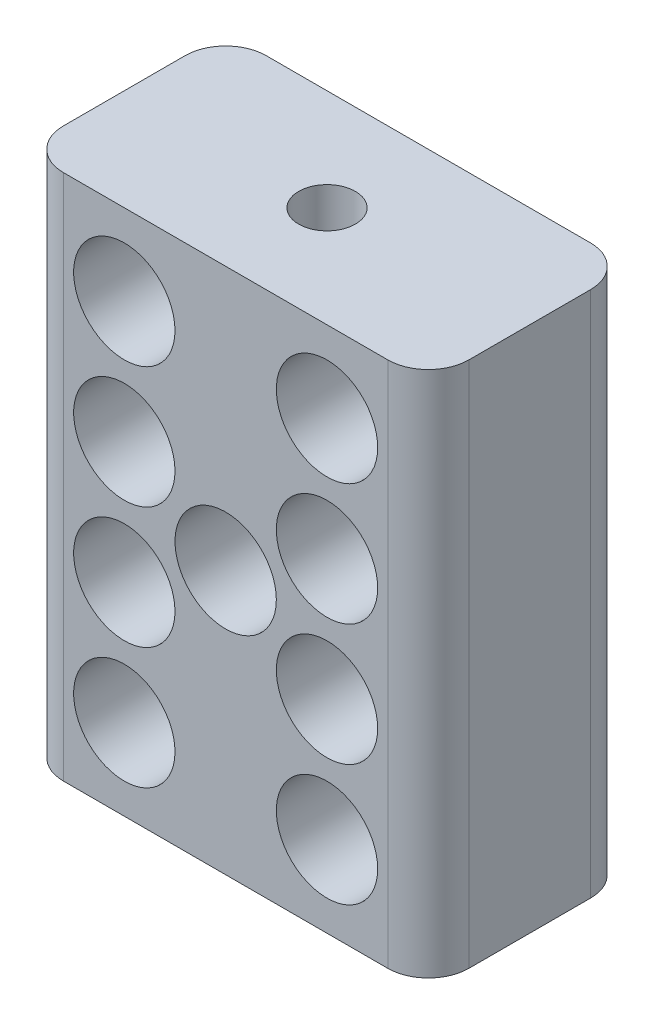
ISO-10303-21;
HEADER;
FILE_DESCRIPTION(('STEP AP214'),'2;1');
FILE_NAME('part.step','',(''),(''),'','','');
FILE_SCHEMA(('AUTOMOTIVE_DESIGN { 1 0 10303 214 1 1 1 1 }'));
ENDSEC;
DATA;
#1=APPLICATION_CONTEXT('core data for automotive mechanical design processes');
#2=APPLICATION_PROTOCOL_DEFINITION('international standard','automotive_design',2000,#1);
#3=PRODUCT_CONTEXT('',#1,'mechanical');
#4=PRODUCT('Part','Part','',(#3));
#5=PRODUCT_RELATED_PRODUCT_CATEGORY('part','',(#4));
#6=PRODUCT_DEFINITION_FORMATION('','',#4);
#7=PRODUCT_DEFINITION_CONTEXT('part definition',#1,'design');
#8=PRODUCT_DEFINITION('design','',#6,#7);
#9=PRODUCT_DEFINITION_SHAPE('','',#8);
#10=(LENGTH_UNIT() NAMED_UNIT(*) SI_UNIT(.MILLI.,.METRE.));
#11=(NAMED_UNIT(*) PLANE_ANGLE_UNIT() SI_UNIT($,.RADIAN.));
#12=(NAMED_UNIT(*) SI_UNIT($,.STERADIAN.) SOLID_ANGLE_UNIT());
#13=UNCERTAINTY_MEASURE_WITH_UNIT(LENGTH_MEASURE(1.E-05),#10,'distance_accuracy_value','');
#14=(GEOMETRIC_REPRESENTATION_CONTEXT(3) GLOBAL_UNCERTAINTY_ASSIGNED_CONTEXT((#13)) GLOBAL_UNIT_ASSIGNED_CONTEXT((#10,
#11,#12)) REPRESENTATION_CONTEXT('',''));
#15=CARTESIAN_POINT('',(0.,0.,0.));
#16=DIRECTION('',(0.,0.,1.));
#17=DIRECTION('',(1.,0.,0.));
#18=AXIS2_PLACEMENT_3D('',#15,#16,#17);
#19=CARTESIAN_POINT('',(5.,0.,5.));
#20=DIRECTION('',(1.,0.,0.));
#21=DIRECTION('',(0.,0.,-1.));
#22=AXIS2_PLACEMENT_3D('',#19,#20,#21);
#23=PLANE('',#22);
#24=DIRECTION('',(0.,0.,-1.));
#25=VECTOR('',#24,1.);
#26=CARTESIAN_POINT('',(5.,6.5,5.));
#27=LINE('',#26,#25);
#28=CARTESIAN_POINT('',(5.,6.5,4.));
#29=VERTEX_POINT('',#28);
#30=CARTESIAN_POINT('',(5.,6.5,1.));
#31=VERTEX_POINT('',#30);
#32=EDGE_CURVE('E130',#29,#31,#27,.T.);
#33=ORIENTED_EDGE('',*,*,#32,.F.);
#34=DIRECTION('',(0.,-1.,0.));
#35=VECTOR('',#34,1.);
#36=CARTESIAN_POINT('',(5.,0.,4.));
#37=LINE('',#36,#35);
#38=CARTESIAN_POINT('',(5.,-6.5,4.));
#39=VERTEX_POINT('',#38);
#40=EDGE_CURVE('E11',#29,#39,#37,.T.);
#41=ORIENTED_EDGE('',*,*,#40,.T.);
#42=DIRECTION('',(0.,0.,-1.));
#43=VECTOR('',#42,1.);
#44=CARTESIAN_POINT('',(5.,-6.5,5.));
#45=LINE('',#44,#43);
#46=CARTESIAN_POINT('',(5.,-6.5,1.));
#47=VERTEX_POINT('',#46);
#48=EDGE_CURVE('E125',#39,#47,#45,.T.);
#49=ORIENTED_EDGE('',*,*,#48,.T.);
#50=DIRECTION('',(0.,-1.,0.));
#51=VECTOR('',#50,1.);
#52=CARTESIAN_POINT('',(5.,6.5,1.));
#53=LINE('',#52,#51);
#54=EDGE_CURVE('E45',#47,#31,#53,.F.);
#55=ORIENTED_EDGE('',*,*,#54,.T.);
#56=EDGE_LOOP('',(#33,#41,#49,#55));
#57=FACE_BOUND('',#56,.T.);
#58=ADVANCED_FACE('F37',(#57),#23,.T.);
#59=CARTESIAN_POINT('',(0.,6.5,5.));
#60=DIRECTION('',(0.,1.,0.));
#61=DIRECTION('',(0.,0.,1.));
#62=AXIS2_PLACEMENT_3D('',#59,#60,#61);
#63=PLANE('',#62);
#64=CARTESIAN_POINT('',(0.,6.5,2.5));
#65=DIRECTION('',(0.,1.,0.));
#66=DIRECTION('',(0.,0.,1.));
#67=AXIS2_PLACEMENT_3D('',#64,#65,#66);
#68=CIRCLE('',#67,0.7);
#69=CARTESIAN_POINT('',(0.,6.5,3.2));
#70=VERTEX_POINT('',#69);
#71=EDGE_CURVE('E409',#70,#70,#68,.T.);
#72=ORIENTED_EDGE('',*,*,#71,.F.);
#73=EDGE_LOOP('',(#72));
#74=FACE_BOUND('',#73,.T.);
#75=DIRECTION('',(1.,0.,0.));
#76=VECTOR('',#75,1.);
#77=CARTESIAN_POINT('',(0.,6.5,0.));
#78=LINE('',#77,#76);
#79=CARTESIAN_POINT('',(-4.,6.5,0.));
#80=VERTEX_POINT('',#79);
#81=CARTESIAN_POINT('',(4.,6.5,0.));
#82=VERTEX_POINT('',#81);
#83=EDGE_CURVE('E195',#80,#82,#78,.T.);
#84=ORIENTED_EDGE('',*,*,#83,.F.);
#85=CARTESIAN_POINT('',(-4.,6.5,1.));
#86=DIRECTION('',(0.,1.,0.));
#87=DIRECTION('',(0.,0.,1.));
#88=AXIS2_PLACEMENT_3D('',#85,#86,#87);
#89=CIRCLE('',#88,1.);
#90=CARTESIAN_POINT('',(-5.,6.5,1.));
#91=VERTEX_POINT('',#90);
#92=EDGE_CURVE('E149',#80,#91,#89,.T.);
#93=ORIENTED_EDGE('',*,*,#92,.T.);
#94=DIRECTION('',(0.,0.,-1.));
#95=VECTOR('',#94,1.);
#96=CARTESIAN_POINT('',(-5.,6.5,5.));
#97=LINE('',#96,#95);
#98=CARTESIAN_POINT('',(-5.,6.5,4.));
#99=VERTEX_POINT('',#98);
#100=EDGE_CURVE('E124',#99,#91,#97,.T.);
#101=ORIENTED_EDGE('',*,*,#100,.F.);
#102=CARTESIAN_POINT('',(-4.,6.5,4.));
#103=DIRECTION('',(0.,1.,0.));
#104=DIRECTION('',(0.,0.,1.));
#105=AXIS2_PLACEMENT_3D('',#102,#103,#104);
#106=CIRCLE('',#105,1.);
#107=CARTESIAN_POINT('',(-4.,6.5,5.));
#108=VERTEX_POINT('',#107);
#109=EDGE_CURVE('E129',#99,#108,#106,.T.);
#110=ORIENTED_EDGE('',*,*,#109,.T.);
#111=DIRECTION('',(1.,0.,0.));
#112=VECTOR('',#111,1.);
#113=CARTESIAN_POINT('',(0.,6.5,5.));
#114=LINE('',#113,#112);
#115=CARTESIAN_POINT('',(4.,6.5,5.));
#116=VERTEX_POINT('',#115);
#117=EDGE_CURVE('E158',#108,#116,#114,.T.);
#118=ORIENTED_EDGE('',*,*,#117,.T.);
#119=CARTESIAN_POINT('',(4.,6.5,4.));
#120=DIRECTION('',(0.,1.,0.));
#121=DIRECTION('',(0.,0.,1.));
#122=AXIS2_PLACEMENT_3D('',#119,#120,#121);
#123=CIRCLE('',#122,1.);
#124=EDGE_CURVE('E58',#116,#29,#123,.T.);
#125=ORIENTED_EDGE('',*,*,#124,.T.);
#126=ORIENTED_EDGE('',*,*,#32,.T.);
#127=CARTESIAN_POINT('',(4.,6.5,1.));
#128=DIRECTION('',(0.,1.,0.));
#129=DIRECTION('',(0.,0.,1.));
#130=AXIS2_PLACEMENT_3D('',#127,#128,#129);
#131=CIRCLE('',#130,1.);
#132=EDGE_CURVE('E145',#31,#82,#131,.T.);
#133=ORIENTED_EDGE('',*,*,#132,.T.);
#134=EDGE_LOOP('',(#84,#93,#101,#110,#118,#125,#126,#133));
#135=FACE_BOUND('',#134,.T.);
#136=ADVANCED_FACE('F225',(#74,#135),#63,.T.);
#137=CARTESIAN_POINT('',(-5.,0.,5.));
#138=DIRECTION('',(1.,0.,0.));
#139=DIRECTION('',(0.,0.,-1.));
#140=AXIS2_PLACEMENT_3D('',#137,#138,#139);
#141=PLANE('',#140);
#142=ORIENTED_EDGE('',*,*,#100,.T.);
#143=DIRECTION('',(0.,-1.,0.));
#144=VECTOR('',#143,1.);
#145=CARTESIAN_POINT('',(-5.,0.,1.));
#146=LINE('',#145,#144);
#147=CARTESIAN_POINT('',(-5.,-6.5,1.));
#148=VERTEX_POINT('',#147);
#149=EDGE_CURVE('E123',#91,#148,#146,.T.);
#150=ORIENTED_EDGE('',*,*,#149,.T.);
#151=DIRECTION('',(0.,0.,-1.));
#152=VECTOR('',#151,1.);
#153=CARTESIAN_POINT('',(-5.,-6.5,5.));
#154=LINE('',#153,#152);
#155=CARTESIAN_POINT('',(-5.,-6.5,4.));
#156=VERTEX_POINT('',#155);
#157=EDGE_CURVE('E106',#156,#148,#154,.T.);
#158=ORIENTED_EDGE('',*,*,#157,.F.);
#159=DIRECTION('',(0.,-1.,0.));
#160=VECTOR('',#159,1.);
#161=CARTESIAN_POINT('',(-5.,6.5,4.));
#162=LINE('',#161,#160);
#163=EDGE_CURVE('E120',#156,#99,#162,.F.);
#164=ORIENTED_EDGE('',*,*,#163,.T.);
#165=EDGE_LOOP('',(#142,#150,#158,#164));
#166=FACE_BOUND('',#165,.T.);
#167=ADVANCED_FACE('F119',(#166),#141,.F.);
#168=CARTESIAN_POINT('',(-2.5,4.5,5.));
#169=DIRECTION('',(0.,0.,-1.));
#170=DIRECTION('',(-1.,0.,0.));
#171=AXIS2_PLACEMENT_3D('',#168,#169,#170);
#172=CYLINDRICAL_SURFACE('',#171,1.25);
#173=CARTESIAN_POINT('',(-2.5,4.5,5.));
#174=DIRECTION('',(0.,0.,1.));
#175=DIRECTION('',(1.,0.,0.));
#176=AXIS2_PLACEMENT_3D('',#173,#174,#175);
#177=CIRCLE('',#176,1.25);
#178=CARTESIAN_POINT('',(-1.25,4.5,5.));
#179=VERTEX_POINT('',#178);
#180=EDGE_CURVE('E159',#179,#179,#177,.T.);
#181=ORIENTED_EDGE('',*,*,#180,.T.);
#182=EDGE_LOOP('',(#181));
#183=FACE_BOUND('',#182,.T.);
#184=CARTESIAN_POINT('',(-2.5,4.5,0.));
#185=DIRECTION('',(0.,0.,1.));
#186=DIRECTION('',(1.,0.,0.));
#187=AXIS2_PLACEMENT_3D('',#184,#185,#186);
#188=CIRCLE('',#187,1.25);
#189=CARTESIAN_POINT('',(-1.25,4.5,0.));
#190=VERTEX_POINT('',#189);
#191=EDGE_CURVE('E192',#190,#190,#188,.T.);
#192=ORIENTED_EDGE('',*,*,#191,.F.);
#193=EDGE_LOOP('',(#192));
#194=FACE_BOUND('',#193,.T.);
#195=ADVANCED_FACE('F234',(#183,#194),#172,.F.);
#196=CARTESIAN_POINT('',(2.5,4.5,5.));
#197=DIRECTION('',(0.,0.,-1.));
#198=DIRECTION('',(-1.,0.,0.));
#199=AXIS2_PLACEMENT_3D('',#196,#197,#198);
#200=CYLINDRICAL_SURFACE('',#199,1.25);
#201=CARTESIAN_POINT('',(2.5,4.5,5.));
#202=DIRECTION('',(0.,0.,1.));
#203=DIRECTION('',(1.,0.,0.));
#204=AXIS2_PLACEMENT_3D('',#201,#202,#203);
#205=CIRCLE('',#204,1.25);
#206=CARTESIAN_POINT('',(3.75,4.5,5.));
#207=VERTEX_POINT('',#206);
#208=EDGE_CURVE('E163',#207,#207,#205,.T.);
#209=ORIENTED_EDGE('',*,*,#208,.T.);
#210=EDGE_LOOP('',(#209));
#211=FACE_BOUND('',#210,.T.);
#212=CARTESIAN_POINT('',(2.5,4.5,0.));
#213=DIRECTION('',(0.,0.,1.));
#214=DIRECTION('',(1.,0.,0.));
#215=AXIS2_PLACEMENT_3D('',#212,#213,#214);
#216=CIRCLE('',#215,1.25);
#217=CARTESIAN_POINT('',(3.75,4.5,0.));
#218=VERTEX_POINT('',#217);
#219=EDGE_CURVE('E189',#218,#218,#216,.T.);
#220=ORIENTED_EDGE('',*,*,#219,.F.);
#221=EDGE_LOOP('',(#220));
#222=FACE_BOUND('',#221,.T.);
#223=ADVANCED_FACE('F237',(#211,#222),#200,.F.);
#224=CARTESIAN_POINT('',(2.50000000000003,1.5,5.));
#225=DIRECTION('',(0.,0.,-1.));
#226=DIRECTION('',(-1.,0.,0.));
#227=AXIS2_PLACEMENT_3D('',#224,#225,#226);
#228=CYLINDRICAL_SURFACE('',#227,1.25);
#229=CARTESIAN_POINT('',(2.50000000000003,1.5,5.));
#230=DIRECTION('',(0.,0.,1.));
#231=DIRECTION('',(1.,0.,0.));
#232=AXIS2_PLACEMENT_3D('',#229,#230,#231);
#233=CIRCLE('',#232,1.25);
#234=CARTESIAN_POINT('',(3.75000000000003,1.5,5.));
#235=VERTEX_POINT('',#234);
#236=EDGE_CURVE('E436',#235,#235,#233,.T.);
#237=ORIENTED_EDGE('',*,*,#236,.T.);
#238=EDGE_LOOP('',(#237));
#239=FACE_BOUND('',#238,.T.);
#240=CARTESIAN_POINT('',(2.50000000000003,1.5,0.));
#241=DIRECTION('',(0.,0.,1.));
#242=DIRECTION('',(1.,0.,0.));
#243=AXIS2_PLACEMENT_3D('',#240,#241,#242);
#244=CIRCLE('',#243,1.25);
#245=CARTESIAN_POINT('',(3.75000000000003,1.5,0.));
#246=VERTEX_POINT('',#245);
#247=EDGE_CURVE('E186',#246,#246,#244,.T.);
#248=ORIENTED_EDGE('',*,*,#247,.F.);
#249=EDGE_LOOP('',(#248));
#250=FACE_BOUND('',#249,.T.);
#251=ADVANCED_FACE('F241',(#239,#250),#228,.F.);
#252=CARTESIAN_POINT('',(2.50000000000006,-1.5,5.));
#253=DIRECTION('',(0.,0.,-1.));
#254=DIRECTION('',(-1.,0.,0.));
#255=AXIS2_PLACEMENT_3D('',#252,#253,#254);
#256=CYLINDRICAL_SURFACE('',#255,1.25);
#257=CARTESIAN_POINT('',(2.50000000000006,-1.5,5.));
#258=DIRECTION('',(0.,0.,1.));
#259=DIRECTION('',(1.,0.,0.));
#260=AXIS2_PLACEMENT_3D('',#257,#258,#259);
#261=CIRCLE('',#260,1.25);
#262=CARTESIAN_POINT('',(3.75000000000006,-1.5,5.));
#263=VERTEX_POINT('',#262);
#264=EDGE_CURVE('E433',#263,#263,#261,.T.);
#265=ORIENTED_EDGE('',*,*,#264,.T.);
#266=EDGE_LOOP('',(#265));
#267=FACE_BOUND('',#266,.T.);
#268=CARTESIAN_POINT('',(2.50000000000006,-1.5,0.));
#269=DIRECTION('',(0.,0.,1.));
#270=DIRECTION('',(1.,0.,0.));
#271=AXIS2_PLACEMENT_3D('',#268,#269,#270);
#272=CIRCLE('',#271,1.25);
#273=CARTESIAN_POINT('',(3.75000000000006,-1.5,0.));
#274=VERTEX_POINT('',#273);
#275=EDGE_CURVE('E183',#274,#274,#272,.T.);
#276=ORIENTED_EDGE('',*,*,#275,.F.);
#277=EDGE_LOOP('',(#276));
#278=FACE_BOUND('',#277,.T.);
#279=ADVANCED_FACE('F245',(#267,#278),#256,.F.);
#280=CARTESIAN_POINT('',(2.50000000000009,-4.5,5.));
#281=DIRECTION('',(0.,0.,-1.));
#282=DIRECTION('',(-1.,0.,0.));
#283=AXIS2_PLACEMENT_3D('',#280,#281,#282);
#284=CYLINDRICAL_SURFACE('',#283,1.25);
#285=CARTESIAN_POINT('',(2.50000000000009,-4.5,5.));
#286=DIRECTION('',(0.,0.,1.));
#287=DIRECTION('',(1.,0.,0.));
#288=AXIS2_PLACEMENT_3D('',#285,#286,#287);
#289=CIRCLE('',#288,1.25);
#290=CARTESIAN_POINT('',(3.75000000000009,-4.5,5.));
#291=VERTEX_POINT('',#290);
#292=EDGE_CURVE('E430',#291,#291,#289,.T.);
#293=ORIENTED_EDGE('',*,*,#292,.T.);
#294=EDGE_LOOP('',(#293));
#295=FACE_BOUND('',#294,.T.);
#296=CARTESIAN_POINT('',(2.50000000000009,-4.5,0.));
#297=DIRECTION('',(0.,0.,1.));
#298=DIRECTION('',(1.,0.,0.));
#299=AXIS2_PLACEMENT_3D('',#296,#297,#298);
#300=CIRCLE('',#299,1.25);
#301=CARTESIAN_POINT('',(3.75000000000009,-4.5,0.));
#302=VERTEX_POINT('',#301);
#303=EDGE_CURVE('E180',#302,#302,#300,.T.);
#304=ORIENTED_EDGE('',*,*,#303,.F.);
#305=EDGE_LOOP('',(#304));
#306=FACE_BOUND('',#305,.T.);
#307=ADVANCED_FACE('F249',(#295,#306),#284,.F.);
#308=CARTESIAN_POINT('',(-2.49999999999997,1.5,5.));
#309=DIRECTION('',(0.,0.,-1.));
#310=DIRECTION('',(-1.,0.,0.));
#311=AXIS2_PLACEMENT_3D('',#308,#309,#310);
#312=CYLINDRICAL_SURFACE('',#311,1.25);
#313=CARTESIAN_POINT('',(-2.49999999999997,1.5,5.));
#314=DIRECTION('',(0.,0.,1.));
#315=DIRECTION('',(1.,0.,0.));
#316=AXIS2_PLACEMENT_3D('',#313,#314,#315);
#317=CIRCLE('',#316,1.25);
#318=CARTESIAN_POINT('',(-1.24999999999997,1.5,5.));
#319=VERTEX_POINT('',#318);
#320=EDGE_CURVE('E427',#319,#319,#317,.T.);
#321=ORIENTED_EDGE('',*,*,#320,.T.);
#322=EDGE_LOOP('',(#321));
#323=FACE_BOUND('',#322,.T.);
#324=CARTESIAN_POINT('',(-2.49999999999997,1.5,0.));
#325=DIRECTION('',(0.,0.,1.));
#326=DIRECTION('',(1.,0.,0.));
#327=AXIS2_PLACEMENT_3D('',#324,#325,#326);
#328=CIRCLE('',#327,1.25);
#329=CARTESIAN_POINT('',(-1.24999999999997,1.5,0.));
#330=VERTEX_POINT('',#329);
#331=EDGE_CURVE('E177',#330,#330,#328,.T.);
#332=ORIENTED_EDGE('',*,*,#331,.F.);
#333=EDGE_LOOP('',(#332));
#334=FACE_BOUND('',#333,.T.);
#335=ADVANCED_FACE('F253',(#323,#334),#312,.F.);
#336=CARTESIAN_POINT('',(-2.49999999999994,-1.5,5.));
#337=DIRECTION('',(0.,0.,-1.));
#338=DIRECTION('',(-1.,0.,0.));
#339=AXIS2_PLACEMENT_3D('',#336,#337,#338);
#340=CYLINDRICAL_SURFACE('',#339,1.25);
#341=CARTESIAN_POINT('',(-2.49999999999994,-1.5,5.));
#342=DIRECTION('',(0.,0.,1.));
#343=DIRECTION('',(1.,0.,0.));
#344=AXIS2_PLACEMENT_3D('',#341,#342,#343);
#345=CIRCLE('',#344,1.25);
#346=CARTESIAN_POINT('',(-1.24999999999994,-1.5,5.));
#347=VERTEX_POINT('',#346);
#348=EDGE_CURVE('E424',#347,#347,#345,.T.);
#349=ORIENTED_EDGE('',*,*,#348,.T.);
#350=EDGE_LOOP('',(#349));
#351=FACE_BOUND('',#350,.T.);
#352=CARTESIAN_POINT('',(-2.49999999999994,-1.5,0.));
#353=DIRECTION('',(0.,0.,1.));
#354=DIRECTION('',(1.,0.,0.));
#355=AXIS2_PLACEMENT_3D('',#352,#353,#354);
#356=CIRCLE('',#355,1.25);
#357=CARTESIAN_POINT('',(-1.24999999999994,-1.5,0.));
#358=VERTEX_POINT('',#357);
#359=EDGE_CURVE('E174',#358,#358,#356,.T.);
#360=ORIENTED_EDGE('',*,*,#359,.F.);
#361=EDGE_LOOP('',(#360));
#362=FACE_BOUND('',#361,.T.);
#363=ADVANCED_FACE('F257',(#351,#362),#340,.F.);
#364=CARTESIAN_POINT('',(-2.49999999999991,-4.5,5.));
#365=DIRECTION('',(0.,0.,-1.));
#366=DIRECTION('',(-1.,0.,0.));
#367=AXIS2_PLACEMENT_3D('',#364,#365,#366);
#368=CYLINDRICAL_SURFACE('',#367,1.25);
#369=CARTESIAN_POINT('',(-2.49999999999991,-4.5,5.));
#370=DIRECTION('',(0.,0.,1.));
#371=DIRECTION('',(1.,0.,0.));
#372=AXIS2_PLACEMENT_3D('',#369,#370,#371);
#373=CIRCLE('',#372,1.25);
#374=CARTESIAN_POINT('',(-1.24999999999991,-4.5,5.));
#375=VERTEX_POINT('',#374);
#376=EDGE_CURVE('E421',#375,#375,#373,.T.);
#377=ORIENTED_EDGE('',*,*,#376,.T.);
#378=EDGE_LOOP('',(#377));
#379=FACE_BOUND('',#378,.T.);
#380=CARTESIAN_POINT('',(-2.49999999999991,-4.5,0.));
#381=DIRECTION('',(0.,0.,1.));
#382=DIRECTION('',(1.,0.,0.));
#383=AXIS2_PLACEMENT_3D('',#380,#381,#382);
#384=CIRCLE('',#383,1.25);
#385=CARTESIAN_POINT('',(-1.24999999999991,-4.5,0.));
#386=VERTEX_POINT('',#385);
#387=EDGE_CURVE('E170',#386,#386,#384,.T.);
#388=ORIENTED_EDGE('',*,*,#387,.F.);
#389=EDGE_LOOP('',(#388));
#390=FACE_BOUND('',#389,.T.);
#391=ADVANCED_FACE('F261',(#379,#390),#368,.F.);
#392=CARTESIAN_POINT('',(0.,0.,5.));
#393=DIRECTION('',(0.,0.,-1.));
#394=DIRECTION('',(-1.,0.,0.));
#395=AXIS2_PLACEMENT_3D('',#392,#393,#394);
#396=CYLINDRICAL_SURFACE('',#395,1.25);
#397=CARTESIAN_POINT('',(0.,0.,5.));
#398=DIRECTION('',(0.,0.,1.));
#399=DIRECTION('',(1.,0.,0.));
#400=AXIS2_PLACEMENT_3D('',#397,#398,#399);
#401=CIRCLE('',#400,1.25);
#402=CARTESIAN_POINT('',(1.25,0.,5.));
#403=VERTEX_POINT('',#402);
#404=EDGE_CURVE('E201',#403,#403,#401,.T.);
#405=ORIENTED_EDGE('',*,*,#404,.T.);
#406=EDGE_LOOP('',(#405));
#407=FACE_BOUND('',#406,.T.);
#408=CARTESIAN_POINT('',(0.,0.,0.));
#409=DIRECTION('',(0.,0.,1.));
#410=DIRECTION('',(1.,0.,0.));
#411=AXIS2_PLACEMENT_3D('',#408,#409,#410);
#412=CIRCLE('',#411,1.25);
#413=CARTESIAN_POINT('',(1.25,0.,0.));
#414=VERTEX_POINT('',#413);
#415=EDGE_CURVE('E167',#414,#414,#412,.T.);
#416=ORIENTED_EDGE('',*,*,#415,.F.);
#417=EDGE_LOOP('',(#416));
#418=FACE_BOUND('',#417,.T.);
#419=ADVANCED_FACE('F265',(#407,#418),#396,.F.);
#420=CARTESIAN_POINT('',(0.,-6.5,5.));
#421=DIRECTION('',(0.,1.,0.));
#422=DIRECTION('',(0.,0.,1.));
#423=AXIS2_PLACEMENT_3D('',#420,#421,#422);
#424=PLANE('',#423);
#425=CARTESIAN_POINT('',(0.,-6.5,2.5));
#426=DIRECTION('',(0.,1.,0.));
#427=DIRECTION('',(0.,0.,1.));
#428=AXIS2_PLACEMENT_3D('',#425,#426,#427);
#429=CIRCLE('',#428,0.7);
#430=CARTESIAN_POINT('',(0.,-6.5,3.2));
#431=VERTEX_POINT('',#430);
#432=EDGE_CURVE('E410',#431,#431,#429,.T.);
#433=ORIENTED_EDGE('',*,*,#432,.T.);
#434=EDGE_LOOP('',(#433));
#435=FACE_BOUND('',#434,.T.);
#436=ORIENTED_EDGE('',*,*,#157,.T.);
#437=CARTESIAN_POINT('',(-4.,-6.5,1.));
#438=DIRECTION('',(0.,1.,0.));
#439=DIRECTION('',(0.,0.,1.));
#440=AXIS2_PLACEMENT_3D('',#437,#438,#439);
#441=CIRCLE('',#440,1.);
#442=CARTESIAN_POINT('',(-4.,-6.5,0.));
#443=VERTEX_POINT('',#442);
#444=EDGE_CURVE('E113',#148,#443,#441,.F.);
#445=ORIENTED_EDGE('',*,*,#444,.T.);
#446=DIRECTION('',(1.,0.,0.));
#447=VECTOR('',#446,1.);
#448=CARTESIAN_POINT('',(0.,-6.5,0.));
#449=LINE('',#448,#447);
#450=CARTESIAN_POINT('',(4.,-6.5,0.));
#451=VERTEX_POINT('',#450);
#452=EDGE_CURVE('E198',#443,#451,#449,.T.);
#453=ORIENTED_EDGE('',*,*,#452,.T.);
#454=CARTESIAN_POINT('',(4.,-6.5,1.));
#455=DIRECTION('',(0.,1.,0.));
#456=DIRECTION('',(0.,0.,1.));
#457=AXIS2_PLACEMENT_3D('',#454,#455,#456);
#458=CIRCLE('',#457,1.);
#459=EDGE_CURVE('E132',#451,#47,#458,.F.);
#460=ORIENTED_EDGE('',*,*,#459,.T.);
#461=ORIENTED_EDGE('',*,*,#48,.F.);
#462=CARTESIAN_POINT('',(4.,-6.5,4.));
#463=DIRECTION('',(0.,1.,0.));
#464=DIRECTION('',(0.,0.,1.));
#465=AXIS2_PLACEMENT_3D('',#462,#463,#464);
#466=CIRCLE('',#465,1.);
#467=CARTESIAN_POINT('',(4.,-6.5,5.));
#468=VERTEX_POINT('',#467);
#469=EDGE_CURVE('E114',#39,#468,#466,.F.);
#470=ORIENTED_EDGE('',*,*,#469,.T.);
#471=DIRECTION('',(1.,0.,0.));
#472=VECTOR('',#471,1.);
#473=CARTESIAN_POINT('',(0.,-6.5,5.));
#474=LINE('',#473,#472);
#475=CARTESIAN_POINT('',(-4.,-6.5,5.));
#476=VERTEX_POINT('',#475);
#477=EDGE_CURVE('E108',#476,#468,#474,.T.);
#478=ORIENTED_EDGE('',*,*,#477,.F.);
#479=CARTESIAN_POINT('',(-4.,-6.5,4.));
#480=DIRECTION('',(0.,1.,0.));
#481=DIRECTION('',(0.,0.,1.));
#482=AXIS2_PLACEMENT_3D('',#479,#480,#481);
#483=CIRCLE('',#482,1.);
#484=EDGE_CURVE('E103',#476,#156,#483,.F.);
#485=ORIENTED_EDGE('',*,*,#484,.T.);
#486=EDGE_LOOP('',(#436,#445,#453,#460,#461,#470,#478,#485));
#487=FACE_BOUND('',#486,.T.);
#488=ADVANCED_FACE('F105',(#435,#487),#424,.F.);
#489=CARTESIAN_POINT('',(0.,0.,5.));
#490=DIRECTION('',(0.,0.,1.));
#491=DIRECTION('',(1.,0.,0.));
#492=AXIS2_PLACEMENT_3D('',#489,#490,#491);
#493=PLANE('',#492);
#494=ORIENTED_EDGE('',*,*,#404,.F.);
#495=EDGE_LOOP('',(#494));
#496=FACE_BOUND('',#495,.T.);
#497=ORIENTED_EDGE('',*,*,#376,.F.);
#498=EDGE_LOOP('',(#497));
#499=FACE_BOUND('',#498,.T.);
#500=ORIENTED_EDGE('',*,*,#348,.F.);
#501=EDGE_LOOP('',(#500));
#502=FACE_BOUND('',#501,.T.);
#503=ORIENTED_EDGE('',*,*,#320,.F.);
#504=EDGE_LOOP('',(#503));
#505=FACE_BOUND('',#504,.T.);
#506=ORIENTED_EDGE('',*,*,#292,.F.);
#507=EDGE_LOOP('',(#506));
#508=FACE_BOUND('',#507,.T.);
#509=ORIENTED_EDGE('',*,*,#264,.F.);
#510=EDGE_LOOP('',(#509));
#511=FACE_BOUND('',#510,.T.);
#512=ORIENTED_EDGE('',*,*,#236,.F.);
#513=EDGE_LOOP('',(#512));
#514=FACE_BOUND('',#513,.T.);
#515=ORIENTED_EDGE('',*,*,#208,.F.);
#516=EDGE_LOOP('',(#515));
#517=FACE_BOUND('',#516,.T.);
#518=ORIENTED_EDGE('',*,*,#180,.F.);
#519=EDGE_LOOP('',(#518));
#520=FACE_BOUND('',#519,.T.);
#521=ORIENTED_EDGE('',*,*,#117,.F.);
#522=DIRECTION('',(0.,-1.,0.));
#523=VECTOR('',#522,1.);
#524=CARTESIAN_POINT('',(-4.,-6.5,5.));
#525=LINE('',#524,#523);
#526=EDGE_CURVE('E153',#108,#476,#525,.T.);
#527=ORIENTED_EDGE('',*,*,#526,.T.);
#528=ORIENTED_EDGE('',*,*,#477,.T.);
#529=DIRECTION('',(0.,-1.,0.));
#530=VECTOR('',#529,1.);
#531=CARTESIAN_POINT('',(4.,0.,5.));
#532=LINE('',#531,#530);
#533=EDGE_CURVE('E151',#468,#116,#532,.F.);
#534=ORIENTED_EDGE('',*,*,#533,.T.);
#535=EDGE_LOOP('',(#521,#527,#528,#534));
#536=FACE_BOUND('',#535,.T.);
#537=ADVANCED_FACE('F156',(#496,#499,#502,#505,#508,#511,#514,#517,#520,#536),#493,.T.);
#538=CARTESIAN_POINT('',(0.,0.,0.));
#539=DIRECTION('',(0.,0.,1.));
#540=DIRECTION('',(1.,0.,0.));
#541=AXIS2_PLACEMENT_3D('',#538,#539,#540);
#542=PLANE('',#541);
#543=ORIENTED_EDGE('',*,*,#415,.T.);
#544=EDGE_LOOP('',(#543));
#545=FACE_BOUND('',#544,.T.);
#546=ORIENTED_EDGE('',*,*,#387,.T.);
#547=EDGE_LOOP('',(#546));
#548=FACE_BOUND('',#547,.T.);
#549=ORIENTED_EDGE('',*,*,#359,.T.);
#550=EDGE_LOOP('',(#549));
#551=FACE_BOUND('',#550,.T.);
#552=ORIENTED_EDGE('',*,*,#331,.T.);
#553=EDGE_LOOP('',(#552));
#554=FACE_BOUND('',#553,.T.);
#555=ORIENTED_EDGE('',*,*,#303,.T.);
#556=EDGE_LOOP('',(#555));
#557=FACE_BOUND('',#556,.T.);
#558=ORIENTED_EDGE('',*,*,#275,.T.);
#559=EDGE_LOOP('',(#558));
#560=FACE_BOUND('',#559,.T.);
#561=ORIENTED_EDGE('',*,*,#247,.T.);
#562=EDGE_LOOP('',(#561));
#563=FACE_BOUND('',#562,.T.);
#564=ORIENTED_EDGE('',*,*,#219,.T.);
#565=EDGE_LOOP('',(#564));
#566=FACE_BOUND('',#565,.T.);
#567=ORIENTED_EDGE('',*,*,#191,.T.);
#568=EDGE_LOOP('',(#567));
#569=FACE_BOUND('',#568,.T.);
#570=ORIENTED_EDGE('',*,*,#452,.F.);
#571=DIRECTION('',(0.,-1.,0.));
#572=VECTOR('',#571,1.);
#573=CARTESIAN_POINT('',(-4.,0.,0.));
#574=LINE('',#573,#572);
#575=EDGE_CURVE('E143',#443,#80,#574,.F.);
#576=ORIENTED_EDGE('',*,*,#575,.T.);
#577=ORIENTED_EDGE('',*,*,#83,.T.);
#578=DIRECTION('',(0.,-1.,0.));
#579=VECTOR('',#578,1.);
#580=CARTESIAN_POINT('',(4.,-6.5,0.));
#581=LINE('',#580,#579);
#582=EDGE_CURVE('E140',#82,#451,#581,.T.);
#583=ORIENTED_EDGE('',*,*,#582,.T.);
#584=EDGE_LOOP('',(#570,#576,#577,#583));
#585=FACE_BOUND('',#584,.T.);
#586=ADVANCED_FACE('F208',(#545,#548,#551,#554,#557,#560,#563,#566,#569,#585),#542,.F.);
#587=CARTESIAN_POINT('',(-4.,0.,1.));
#588=DIRECTION('',(0.,-1.,0.));
#589=DIRECTION('',(0.,0.,-1.));
#590=AXIS2_PLACEMENT_3D('',#587,#588,#589);
#591=CYLINDRICAL_SURFACE('',#590,1.);
#592=ORIENTED_EDGE('',*,*,#92,.F.);
#593=ORIENTED_EDGE('',*,*,#575,.F.);
#594=ORIENTED_EDGE('',*,*,#444,.F.);
#595=ORIENTED_EDGE('',*,*,#149,.F.);
#596=EDGE_LOOP('',(#592,#593,#594,#595));
#597=FACE_BOUND('',#596,.T.);
#598=ADVANCED_FACE('F204',(#597),#591,.T.);
#599=CARTESIAN_POINT('',(-4.,0.,4.));
#600=DIRECTION('',(0.,1.,0.));
#601=DIRECTION('',(0.,0.,1.));
#602=AXIS2_PLACEMENT_3D('',#599,#600,#601);
#603=CYLINDRICAL_SURFACE('',#602,1.);
#604=ORIENTED_EDGE('',*,*,#109,.F.);
#605=ORIENTED_EDGE('',*,*,#163,.F.);
#606=ORIENTED_EDGE('',*,*,#484,.F.);
#607=ORIENTED_EDGE('',*,*,#526,.F.);
#608=EDGE_LOOP('',(#604,#605,#606,#607));
#609=FACE_BOUND('',#608,.T.);
#610=ADVANCED_FACE('F128',(#609),#603,.T.);
#611=CARTESIAN_POINT('',(4.,0.,4.));
#612=DIRECTION('',(0.,-1.,0.));
#613=DIRECTION('',(0.,0.,-1.));
#614=AXIS2_PLACEMENT_3D('',#611,#612,#613);
#615=CYLINDRICAL_SURFACE('',#614,1.);
#616=ORIENTED_EDGE('',*,*,#124,.F.);
#617=ORIENTED_EDGE('',*,*,#533,.F.);
#618=ORIENTED_EDGE('',*,*,#469,.F.);
#619=ORIENTED_EDGE('',*,*,#40,.F.);
#620=EDGE_LOOP('',(#616,#617,#618,#619));
#621=FACE_BOUND('',#620,.T.);
#622=ADVANCED_FACE('F216',(#621),#615,.T.);
#623=CARTESIAN_POINT('',(4.,0.,1.));
#624=DIRECTION('',(0.,1.,0.));
#625=DIRECTION('',(0.,0.,1.));
#626=AXIS2_PLACEMENT_3D('',#623,#624,#625);
#627=CYLINDRICAL_SURFACE('',#626,1.);
#628=ORIENTED_EDGE('',*,*,#132,.F.);
#629=ORIENTED_EDGE('',*,*,#54,.F.);
#630=ORIENTED_EDGE('',*,*,#459,.F.);
#631=ORIENTED_EDGE('',*,*,#582,.F.);
#632=EDGE_LOOP('',(#628,#629,#630,#631));
#633=FACE_BOUND('',#632,.T.);
#634=ADVANCED_FACE('F39',(#633),#627,.T.);
#635=CARTESIAN_POINT('',(0.,3.5,2.5));
#636=DIRECTION('',(0.,1.,0.));
#637=DIRECTION('',(0.,0.,1.));
#638=AXIS2_PLACEMENT_3D('',#635,#636,#637);
#639=CYLINDRICAL_SURFACE('',#638,0.7);
#640=CARTESIAN_POINT('',(0.,3.5,2.5));
#641=DIRECTION('',(0.,1.,0.));
#642=DIRECTION('',(0.,0.,1.));
#643=AXIS2_PLACEMENT_3D('',#640,#641,#642);
#644=CIRCLE('',#643,0.7);
#645=CARTESIAN_POINT('',(0.,3.5,3.2));
#646=VERTEX_POINT('',#645);
#647=EDGE_CURVE('E171',#646,#646,#644,.T.);
#648=ORIENTED_EDGE('',*,*,#647,.F.);
#649=EDGE_LOOP('',(#648));
#650=FACE_BOUND('',#649,.T.);
#651=ORIENTED_EDGE('',*,*,#71,.T.);
#652=EDGE_LOOP('',(#651));
#653=FACE_BOUND('',#652,.T.);
#654=ADVANCED_FACE('F222',(#650,#653),#639,.F.);
#655=CARTESIAN_POINT('',(0.,3.5,2.5));
#656=DIRECTION('',(0.,1.,0.));
#657=DIRECTION('',(0.,0.,1.));
#658=AXIS2_PLACEMENT_3D('',#655,#656,#657);
#659=PLANE('',#658);
#660=ORIENTED_EDGE('',*,*,#647,.T.);
#661=EDGE_LOOP('',(#660));
#662=FACE_BOUND('',#661,.T.);
#663=ADVANCED_FACE('F374',(#662),#659,.T.);
#664=CARTESIAN_POINT('',(0.,-3.5,2.5));
#665=DIRECTION('',(0.,-1.,0.));
#666=DIRECTION('',(0.,0.,-1.));
#667=AXIS2_PLACEMENT_3D('',#664,#665,#666);
#668=CYLINDRICAL_SURFACE('',#667,0.7);
#669=CARTESIAN_POINT('',(0.,-3.5,2.5));
#670=DIRECTION('',(0.,1.,0.));
#671=DIRECTION('',(0.,0.,1.));
#672=AXIS2_PLACEMENT_3D('',#669,#670,#671);
#673=CIRCLE('',#672,0.7);
#674=CARTESIAN_POINT('',(0.,-3.5,3.2));
#675=VERTEX_POINT('',#674);
#676=EDGE_CURVE('E408',#675,#675,#673,.T.);
#677=ORIENTED_EDGE('',*,*,#676,.T.);
#678=EDGE_LOOP('',(#677));
#679=FACE_BOUND('',#678,.T.);
#680=ORIENTED_EDGE('',*,*,#432,.F.);
#681=EDGE_LOOP('',(#680));
#682=FACE_BOUND('',#681,.T.);
#683=ADVANCED_FACE('F382',(#679,#682),#668,.F.);
#684=CARTESIAN_POINT('',(0.,-3.5,2.5));
#685=DIRECTION('',(0.,-1.,0.));
#686=DIRECTION('',(0.,0.,1.));
#687=AXIS2_PLACEMENT_3D('',#684,#685,#686);
#688=PLANE('',#687);
#689=ORIENTED_EDGE('',*,*,#676,.F.);
#690=EDGE_LOOP('',(#689));
#691=FACE_BOUND('',#690,.T.);
#692=ADVANCED_FACE('F392',(#691),#688,.T.);
#693=CLOSED_SHELL('',(#58,#136,#167,#195,#223,#251,#279,#307,#335,#363,#391,#419,#488,#537,#586,
#598,#610,#622,#634,#654,#663,#683,#692));
#694=MANIFOLD_SOLID_BREP('B2',#693);
#695=ADVANCED_BREP_SHAPE_REPRESENTATION('',(#18,#694),#14);
#696=SHAPE_DEFINITION_REPRESENTATION(#9,#695);
ENDSEC;
END-ISO-10303-21;
